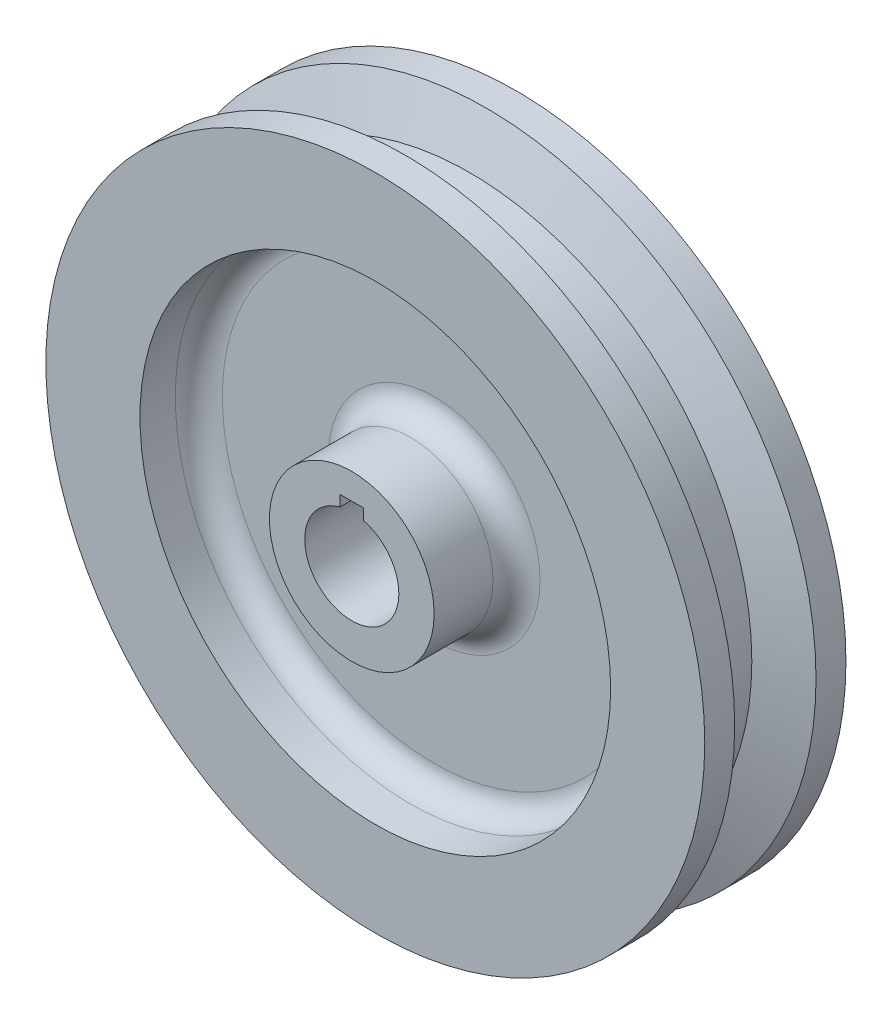
ISO-10303-21;
HEADER;
FILE_DESCRIPTION(('STEP AP214'),'2;1');
FILE_NAME('part.step','',(''),(''),'','','');
FILE_SCHEMA(('AUTOMOTIVE_DESIGN { 1 0 10303 214 1 1 1 1 }'));
ENDSEC;
DATA;
#1=APPLICATION_CONTEXT('core data for automotive mechanical design processes');
#2=APPLICATION_PROTOCOL_DEFINITION('international standard','automotive_design',2000,#1);
#3=PRODUCT_CONTEXT('',#1,'mechanical');
#4=PRODUCT('Part','Part','',(#3));
#5=PRODUCT_RELATED_PRODUCT_CATEGORY('part','',(#4));
#6=PRODUCT_DEFINITION_FORMATION('','',#4);
#7=PRODUCT_DEFINITION_CONTEXT('part definition',#1,'design');
#8=PRODUCT_DEFINITION('design','',#6,#7);
#9=PRODUCT_DEFINITION_SHAPE('','',#8);
#10=(LENGTH_UNIT() NAMED_UNIT(*) SI_UNIT(.MILLI.,.METRE.));
#11=(NAMED_UNIT(*) PLANE_ANGLE_UNIT() SI_UNIT($,.RADIAN.));
#12=(NAMED_UNIT(*) SI_UNIT($,.STERADIAN.) SOLID_ANGLE_UNIT());
#13=UNCERTAINTY_MEASURE_WITH_UNIT(LENGTH_MEASURE(1.E-05),#10,'distance_accuracy_value','');
#14=(GEOMETRIC_REPRESENTATION_CONTEXT(3) GLOBAL_UNCERTAINTY_ASSIGNED_CONTEXT((#13)) GLOBAL_UNIT_ASSIGNED_CONTEXT((#10,
#11,#12)) REPRESENTATION_CONTEXT('',''));
#15=CARTESIAN_POINT('',(0.,0.,0.));
#16=DIRECTION('',(0.,0.,1.));
#17=DIRECTION('',(1.,0.,0.));
#18=AXIS2_PLACEMENT_3D('',#15,#16,#17);
#19=CARTESIAN_POINT('',(0.,0.,0.));
#20=DIRECTION('',(0.,0.,1.));
#21=DIRECTION('',(1.,0.,0.));
#22=AXIS2_PLACEMENT_3D('',#19,#20,#21);
#23=CYLINDRICAL_SURFACE('',#22,88.9);
#24=CARTESIAN_POINT('',(0.,0.,19.05));
#25=DIRECTION('',(0.,0.,1.));
#26=DIRECTION('',(1.,0.,0.));
#27=AXIS2_PLACEMENT_3D('',#24,#25,#26);
#28=CIRCLE('',#27,88.9);
#29=CARTESIAN_POINT('',(88.9,0.,19.05));
#30=VERTEX_POINT('',#29);
#31=EDGE_CURVE('E115',#30,#30,#28,.T.);
#32=ORIENTED_EDGE('',*,*,#31,.F.);
#33=EDGE_LOOP('',(#32));
#34=FACE_BOUND('',#33,.T.);
#35=CARTESIAN_POINT('',(0.,0.,10.9724219751807));
#36=DIRECTION('',(0.,0.,1.));
#37=DIRECTION('',(1.,0.,0.));
#38=AXIS2_PLACEMENT_3D('',#35,#36,#37);
#39=CIRCLE('',#38,88.9);
#40=CARTESIAN_POINT('',(88.9,0.,10.9724219751807));
#41=VERTEX_POINT('',#40);
#42=EDGE_CURVE('E381',#41,#41,#39,.T.);
#43=ORIENTED_EDGE('',*,*,#42,.T.);
#44=EDGE_LOOP('',(#43));
#45=FACE_BOUND('',#44,.T.);
#46=ADVANCED_FACE('F39',(#34,#45),#23,.T.);
#47=CARTESIAN_POINT('',(0.,0.,-19.05));
#48=DIRECTION('',(0.,0.,1.));
#49=DIRECTION('',(1.,0.,0.));
#50=AXIS2_PLACEMENT_3D('',#47,#48,#49);
#51=CIRCLE('',#50,88.9);
#52=CARTESIAN_POINT('',(88.9,0.,-19.05));
#53=VERTEX_POINT('',#52);
#54=EDGE_CURVE('E384',#53,#53,#51,.T.);
#55=ORIENTED_EDGE('',*,*,#54,.T.);
#56=EDGE_LOOP('',(#55));
#57=FACE_BOUND('',#56,.T.);
#58=CARTESIAN_POINT('',(0.,0.,-10.9724219751807));
#59=DIRECTION('',(0.,0.,1.));
#60=DIRECTION('',(1.,0.,0.));
#61=AXIS2_PLACEMENT_3D('',#58,#59,#60);
#62=CIRCLE('',#61,88.9);
#63=CARTESIAN_POINT('',(88.9,0.,-10.9724219751807));
#64=VERTEX_POINT('',#63);
#65=EDGE_CURVE('E378',#64,#64,#62,.T.);
#66=ORIENTED_EDGE('',*,*,#65,.F.);
#67=EDGE_LOOP('',(#66));
#68=FACE_BOUND('',#67,.T.);
#69=ADVANCED_FACE('F157',(#57,#68),#23,.T.);
#70=CARTESIAN_POINT('',(0.,0.,19.05));
#71=DIRECTION('',(0.,0.,-1.));
#72=DIRECTION('',(-1.,0.,0.));
#73=AXIS2_PLACEMENT_3D('',#70,#71,#72);
#74=PLANE('',#73);
#75=CARTESIAN_POINT('',(0.,0.,19.05));
#76=DIRECTION('',(0.,0.,1.));
#77=DIRECTION('',(1.,0.,0.));
#78=AXIS2_PLACEMENT_3D('',#75,#76,#77);
#79=CIRCLE('',#78,63.5);
#80=CARTESIAN_POINT('',(63.5,0.,19.05));
#81=VERTEX_POINT('',#80);
#82=EDGE_CURVE('E112',#81,#81,#79,.T.);
#83=ORIENTED_EDGE('',*,*,#82,.F.);
#84=EDGE_LOOP('',(#83));
#85=FACE_BOUND('',#84,.T.);
#86=ORIENTED_EDGE('',*,*,#31,.T.);
#87=EDGE_LOOP('',(#86));
#88=FACE_BOUND('',#87,.T.);
#89=ADVANCED_FACE('F164',(#85,#88),#74,.F.);
#90=CARTESIAN_POINT('',(0.,0.,0.));
#91=DIRECTION('',(0.,0.,1.));
#92=DIRECTION('',(1.,0.,0.));
#93=AXIS2_PLACEMENT_3D('',#90,#91,#92);
#94=CYLINDRICAL_SURFACE('',#93,63.5);
#95=CARTESIAN_POINT('',(0.,0.,9.525));
#96=DIRECTION('',(0.,0.,1.));
#97=DIRECTION('',(1.,0.,0.));
#98=AXIS2_PLACEMENT_3D('',#95,#96,#97);
#99=CIRCLE('',#98,63.5);
#100=CARTESIAN_POINT('',(63.5,0.,9.525));
#101=VERTEX_POINT('',#100);
#102=EDGE_CURVE('E136',#101,#101,#99,.F.);
#103=ORIENTED_EDGE('',*,*,#102,.T.);
#104=EDGE_LOOP('',(#103));
#105=FACE_BOUND('',#104,.T.);
#106=ORIENTED_EDGE('',*,*,#82,.T.);
#107=EDGE_LOOP('',(#106));
#108=FACE_BOUND('',#107,.T.);
#109=ADVANCED_FACE('F197',(#105,#108),#94,.F.);
#110=CARTESIAN_POINT('',(0.,0.,3.175));
#111=DIRECTION('',(0.,0.,1.));
#112=DIRECTION('',(1.,0.,0.));
#113=AXIS2_PLACEMENT_3D('',#110,#111,#112);
#114=PLANE('',#113);
#115=CARTESIAN_POINT('',(0.,0.,3.175));
#116=DIRECTION('',(0.,0.,1.));
#117=DIRECTION('',(1.,0.,0.));
#118=AXIS2_PLACEMENT_3D('',#115,#116,#117);
#119=CIRCLE('',#118,57.15);
#120=CARTESIAN_POINT('',(57.15,0.,3.175));
#121=VERTEX_POINT('',#120);
#122=EDGE_CURVE('E133',#121,#121,#119,.T.);
#123=ORIENTED_EDGE('',*,*,#122,.T.);
#124=EDGE_LOOP('',(#123));
#125=FACE_BOUND('',#124,.T.);
#126=CARTESIAN_POINT('',(0.,0.,3.175));
#127=DIRECTION('',(0.,0.,1.));
#128=DIRECTION('',(1.,0.,0.));
#129=AXIS2_PLACEMENT_3D('',#126,#127,#128);
#130=CIRCLE('',#129,28.575);
#131=CARTESIAN_POINT('',(28.575,0.,3.175));
#132=VERTEX_POINT('',#131);
#133=EDGE_CURVE('E130',#132,#132,#130,.F.);
#134=ORIENTED_EDGE('',*,*,#133,.T.);
#135=EDGE_LOOP('',(#134));
#136=FACE_BOUND('',#135,.T.);
#137=ADVANCED_FACE('F210',(#125,#136),#114,.T.);
#138=CARTESIAN_POINT('',(0.,0.,0.));
#139=DIRECTION('',(0.,0.,1.));
#140=DIRECTION('',(1.,0.,0.));
#141=AXIS2_PLACEMENT_3D('',#138,#139,#140);
#142=CYLINDRICAL_SURFACE('',#141,22.225);
#143=CARTESIAN_POINT('',(0.,0.,9.525));
#144=DIRECTION('',(0.,0.,1.));
#145=DIRECTION('',(1.,0.,0.));
#146=AXIS2_PLACEMENT_3D('',#143,#144,#145);
#147=CIRCLE('',#146,22.225);
#148=CARTESIAN_POINT('',(22.225,0.,9.525));
#149=VERTEX_POINT('',#148);
#150=EDGE_CURVE('E47',#149,#149,#147,.T.);
#151=ORIENTED_EDGE('',*,*,#150,.T.);
#152=EDGE_LOOP('',(#151));
#153=FACE_BOUND('',#152,.T.);
#154=CARTESIAN_POINT('',(0.,0.,25.4));
#155=DIRECTION('',(0.,0.,1.));
#156=DIRECTION('',(1.,0.,0.));
#157=AXIS2_PLACEMENT_3D('',#154,#155,#156);
#158=CIRCLE('',#157,22.225);
#159=CARTESIAN_POINT('',(22.225,0.,25.4));
#160=VERTEX_POINT('',#159);
#161=EDGE_CURVE('E103',#160,#160,#158,.T.);
#162=ORIENTED_EDGE('',*,*,#161,.F.);
#163=EDGE_LOOP('',(#162));
#164=FACE_BOUND('',#163,.T.);
#165=ADVANCED_FACE('F141',(#153,#164),#142,.T.);
#166=CARTESIAN_POINT('',(0.,0.,25.4));
#167=DIRECTION('',(0.,0.,-1.));
#168=DIRECTION('',(-1.,0.,0.));
#169=AXIS2_PLACEMENT_3D('',#166,#167,#168);
#170=PLANE('',#169);
#171=DIRECTION('',(-1.,0.,0.));
#172=VECTOR('',#171,1.);
#173=CARTESIAN_POINT('',(3.175,15.24,25.4));
#174=LINE('',#173,#172);
#175=CARTESIAN_POINT('',(3.175,15.24,25.4));
#176=VERTEX_POINT('',#175);
#177=CARTESIAN_POINT('',(-3.175,15.24,25.4));
#178=VERTEX_POINT('',#177);
#179=EDGE_CURVE('E401',#176,#178,#174,.T.);
#180=ORIENTED_EDGE('',*,*,#179,.F.);
#181=DIRECTION('',(0.,1.,0.));
#182=VECTOR('',#181,1.);
#183=CARTESIAN_POINT('',(3.175,0.,25.4));
#184=LINE('',#183,#182);
#185=CARTESIAN_POINT('',(3.175,12.2967221242085,25.4));
#186=VERTEX_POINT('',#185);
#187=EDGE_CURVE('E80',#186,#176,#184,.T.);
#188=ORIENTED_EDGE('',*,*,#187,.F.);
#189=CARTESIAN_POINT('',(0.,0.,25.4));
#190=DIRECTION('',(0.,0.,1.));
#191=DIRECTION('',(1.,0.,0.));
#192=AXIS2_PLACEMENT_3D('',#189,#190,#191);
#193=CIRCLE('',#192,12.7);
#194=CARTESIAN_POINT('',(-3.175,12.2967221242085,25.4));
#195=VERTEX_POINT('',#194);
#196=EDGE_CURVE('E99',#195,#186,#193,.T.);
#197=ORIENTED_EDGE('',*,*,#196,.F.);
#198=DIRECTION('',(0.,-1.,0.));
#199=VECTOR('',#198,1.);
#200=CARTESIAN_POINT('',(-3.175,0.,25.4));
#201=LINE('',#200,#199);
#202=EDGE_CURVE('E90',#178,#195,#201,.T.);
#203=ORIENTED_EDGE('',*,*,#202,.F.);
#204=EDGE_LOOP('',(#180,#188,#197,#203));
#205=FACE_BOUND('',#204,.T.);
#206=ORIENTED_EDGE('',*,*,#161,.T.);
#207=EDGE_LOOP('',(#206));
#208=FACE_BOUND('',#207,.T.);
#209=ADVANCED_FACE('F207',(#205,#208),#170,.F.);
#210=CARTESIAN_POINT('',(0.,0.,0.));
#211=DIRECTION('',(0.,0.,1.));
#212=DIRECTION('',(1.,0.,0.));
#213=AXIS2_PLACEMENT_3D('',#210,#211,#212);
#214=CYLINDRICAL_SURFACE('',#213,12.7);
#215=DIRECTION('',(0.,0.,1.));
#216=VECTOR('',#215,1.);
#217=CARTESIAN_POINT('',(3.175,12.2967221242086,0.));
#218=LINE('',#217,#216);
#219=CARTESIAN_POINT('',(3.175,12.2967221242085,-25.4));
#220=VERTEX_POINT('',#219);
#221=EDGE_CURVE('E367',#220,#186,#218,.T.);
#222=ORIENTED_EDGE('',*,*,#221,.F.);
#223=CARTESIAN_POINT('',(0.,0.,-25.4));
#224=DIRECTION('',(0.,0.,1.));
#225=DIRECTION('',(1.,0.,0.));
#226=AXIS2_PLACEMENT_3D('',#223,#224,#225);
#227=CIRCLE('',#226,12.7);
#228=CARTESIAN_POINT('',(-3.175,12.2967221242085,-25.4));
#229=VERTEX_POINT('',#228);
#230=EDGE_CURVE('E96',#229,#220,#227,.T.);
#231=ORIENTED_EDGE('',*,*,#230,.F.);
#232=DIRECTION('',(0.,0.,1.));
#233=VECTOR('',#232,1.);
#234=CARTESIAN_POINT('',(-3.175,12.2967221242086,0.));
#235=LINE('',#234,#233);
#236=EDGE_CURVE('E364',#195,#229,#235,.F.);
#237=ORIENTED_EDGE('',*,*,#236,.F.);
#238=ORIENTED_EDGE('',*,*,#196,.T.);
#239=EDGE_LOOP('',(#222,#231,#237,#238));
#240=FACE_BOUND('',#239,.T.);
#241=ADVANCED_FACE('F204',(#240),#214,.F.);
#242=CARTESIAN_POINT('',(0.,0.,-25.4));
#243=DIRECTION('',(0.,0.,-1.));
#244=DIRECTION('',(-1.,0.,0.));
#245=AXIS2_PLACEMENT_3D('',#242,#243,#244);
#246=PLANE('',#245);
#247=DIRECTION('',(0.,-1.,0.));
#248=VECTOR('',#247,1.);
#249=CARTESIAN_POINT('',(3.175,0.,-25.4));
#250=LINE('',#249,#248);
#251=CARTESIAN_POINT('',(3.175,15.24,-25.4));
#252=VERTEX_POINT('',#251);
#253=EDGE_CURVE('E11',#252,#220,#250,.T.);
#254=ORIENTED_EDGE('',*,*,#253,.F.);
#255=DIRECTION('',(-1.,0.,0.));
#256=VECTOR('',#255,1.);
#257=CARTESIAN_POINT('',(3.175,15.24,-25.4));
#258=LINE('',#257,#256);
#259=CARTESIAN_POINT('',(-3.175,15.24,-25.4));
#260=VERTEX_POINT('',#259);
#261=EDGE_CURVE('E87',#252,#260,#258,.T.);
#262=ORIENTED_EDGE('',*,*,#261,.T.);
#263=DIRECTION('',(0.,-1.,0.));
#264=VECTOR('',#263,1.);
#265=CARTESIAN_POINT('',(-3.175,0.,-25.4));
#266=LINE('',#265,#264);
#267=EDGE_CURVE('E54',#260,#229,#266,.T.);
#268=ORIENTED_EDGE('',*,*,#267,.T.);
#269=ORIENTED_EDGE('',*,*,#230,.T.);
#270=EDGE_LOOP('',(#254,#262,#268,#269));
#271=FACE_BOUND('',#270,.T.);
#272=CARTESIAN_POINT('',(0.,0.,-25.4));
#273=DIRECTION('',(0.,0.,1.));
#274=DIRECTION('',(1.,0.,0.));
#275=AXIS2_PLACEMENT_3D('',#272,#273,#274);
#276=CIRCLE('',#275,22.225);
#277=CARTESIAN_POINT('',(22.225,0.,-25.4));
#278=VERTEX_POINT('',#277);
#279=EDGE_CURVE('E100',#278,#278,#276,.T.);
#280=ORIENTED_EDGE('',*,*,#279,.F.);
#281=EDGE_LOOP('',(#280));
#282=FACE_BOUND('',#281,.T.);
#283=ADVANCED_FACE('F93',(#271,#282),#246,.T.);
#284=CARTESIAN_POINT('',(0.,0.,-9.525));
#285=DIRECTION('',(0.,0.,1.));
#286=DIRECTION('',(1.,0.,0.));
#287=AXIS2_PLACEMENT_3D('',#284,#285,#286);
#288=CIRCLE('',#287,22.225);
#289=CARTESIAN_POINT('',(22.225,0.,-9.525));
#290=VERTEX_POINT('',#289);
#291=EDGE_CURVE('E127',#290,#290,#288,.F.);
#292=ORIENTED_EDGE('',*,*,#291,.T.);
#293=EDGE_LOOP('',(#292));
#294=FACE_BOUND('',#293,.T.);
#295=ORIENTED_EDGE('',*,*,#279,.T.);
#296=EDGE_LOOP('',(#295));
#297=FACE_BOUND('',#296,.T.);
#298=ADVANCED_FACE('F187',(#294,#297),#142,.T.);
#299=CARTESIAN_POINT('',(0.,0.,-3.175));
#300=DIRECTION('',(0.,0.,1.));
#301=DIRECTION('',(1.,0.,0.));
#302=AXIS2_PLACEMENT_3D('',#299,#300,#301);
#303=PLANE('',#302);
#304=CARTESIAN_POINT('',(0.,0.,-3.175));
#305=DIRECTION('',(0.,0.,1.));
#306=DIRECTION('',(1.,0.,0.));
#307=AXIS2_PLACEMENT_3D('',#304,#305,#306);
#308=CIRCLE('',#307,57.15);
#309=CARTESIAN_POINT('',(57.15,0.,-3.175));
#310=VERTEX_POINT('',#309);
#311=EDGE_CURVE('E124',#310,#310,#308,.F.);
#312=ORIENTED_EDGE('',*,*,#311,.T.);
#313=EDGE_LOOP('',(#312));
#314=FACE_BOUND('',#313,.T.);
#315=CARTESIAN_POINT('',(0.,0.,-3.175));
#316=DIRECTION('',(0.,0.,1.));
#317=DIRECTION('',(1.,0.,0.));
#318=AXIS2_PLACEMENT_3D('',#315,#316,#317);
#319=CIRCLE('',#318,28.575);
#320=CARTESIAN_POINT('',(28.575,0.,-3.175));
#321=VERTEX_POINT('',#320);
#322=EDGE_CURVE('E121',#321,#321,#319,.T.);
#323=ORIENTED_EDGE('',*,*,#322,.T.);
#324=EDGE_LOOP('',(#323));
#325=FACE_BOUND('',#324,.T.);
#326=ADVANCED_FACE('F184',(#314,#325),#303,.F.);
#327=CARTESIAN_POINT('',(0.,0.,-9.525));
#328=DIRECTION('',(0.,0.,1.));
#329=DIRECTION('',(1.,0.,0.));
#330=AXIS2_PLACEMENT_3D('',#327,#328,#329);
#331=CIRCLE('',#330,63.5);
#332=CARTESIAN_POINT('',(63.5,0.,-9.525));
#333=VERTEX_POINT('',#332);
#334=EDGE_CURVE('E118',#333,#333,#331,.T.);
#335=ORIENTED_EDGE('',*,*,#334,.T.);
#336=EDGE_LOOP('',(#335));
#337=FACE_BOUND('',#336,.T.);
#338=CARTESIAN_POINT('',(0.,0.,-19.05));
#339=DIRECTION('',(0.,0.,1.));
#340=DIRECTION('',(1.,0.,0.));
#341=AXIS2_PLACEMENT_3D('',#338,#339,#340);
#342=CIRCLE('',#341,63.5);
#343=CARTESIAN_POINT('',(63.5,0.,-19.05));
#344=VERTEX_POINT('',#343);
#345=EDGE_CURVE('E106',#344,#344,#342,.T.);
#346=ORIENTED_EDGE('',*,*,#345,.F.);
#347=EDGE_LOOP('',(#346));
#348=FACE_BOUND('',#347,.T.);
#349=ADVANCED_FACE('F186',(#337,#348),#94,.F.);
#350=CARTESIAN_POINT('',(0.,0.,-19.05));
#351=DIRECTION('',(0.,0.,-1.));
#352=DIRECTION('',(-1.,0.,0.));
#353=AXIS2_PLACEMENT_3D('',#350,#351,#352);
#354=PLANE('',#353);
#355=ORIENTED_EDGE('',*,*,#345,.T.);
#356=EDGE_LOOP('',(#355));
#357=FACE_BOUND('',#356,.T.);
#358=ORIENTED_EDGE('',*,*,#54,.F.);
#359=EDGE_LOOP('',(#358));
#360=FACE_BOUND('',#359,.T.);
#361=ADVANCED_FACE('F194',(#357,#360),#354,.T.);
#362=CARTESIAN_POINT('',(0.,0.,10.9724219751807));
#363=DIRECTION('',(0.,0.,1.));
#364=DIRECTION('',(1.,0.,0.));
#365=AXIS2_PLACEMENT_3D('',#362,#363,#364);
#366=CONICAL_SURFACE('',#365,88.9,1.22173047639603);
#367=CARTESIAN_POINT('',(0.,0.,6.35));
#368=DIRECTION('',(0.,0.,1.));
#369=DIRECTION('',(1.,0.,0.));
#370=AXIS2_PLACEMENT_3D('',#367,#368,#369);
#371=CIRCLE('',#370,76.2);
#372=CARTESIAN_POINT('',(76.2,0.,6.35));
#373=VERTEX_POINT('',#372);
#374=EDGE_CURVE('E369',#373,#373,#371,.T.);
#375=ORIENTED_EDGE('',*,*,#374,.T.);
#376=EDGE_LOOP('',(#375));
#377=FACE_BOUND('',#376,.T.);
#378=ORIENTED_EDGE('',*,*,#42,.F.);
#379=EDGE_LOOP('',(#378));
#380=FACE_BOUND('',#379,.T.);
#381=ADVANCED_FACE('F292',(#377,#380),#366,.T.);
#382=CARTESIAN_POINT('',(0.,0.,-6.35));
#383=DIRECTION('',(0.,0.,-1.));
#384=DIRECTION('',(-1.,0.,0.));
#385=AXIS2_PLACEMENT_3D('',#382,#383,#384);
#386=CONICAL_SURFACE('',#385,76.2,1.22173047639603);
#387=ORIENTED_EDGE('',*,*,#65,.T.);
#388=EDGE_LOOP('',(#387));
#389=FACE_BOUND('',#388,.T.);
#390=CARTESIAN_POINT('',(0.,0.,-6.35));
#391=DIRECTION('',(0.,0.,1.));
#392=DIRECTION('',(1.,0.,0.));
#393=AXIS2_PLACEMENT_3D('',#390,#391,#392);
#394=CIRCLE('',#393,76.2);
#395=CARTESIAN_POINT('',(76.2,0.,-6.35));
#396=VERTEX_POINT('',#395);
#397=EDGE_CURVE('E375',#396,#396,#394,.T.);
#398=ORIENTED_EDGE('',*,*,#397,.F.);
#399=EDGE_LOOP('',(#398));
#400=FACE_BOUND('',#399,.T.);
#401=ADVANCED_FACE('F308',(#389,#400),#386,.T.);
#402=CARTESIAN_POINT('',(0.,0.,0.));
#403=DIRECTION('',(0.,0.,1.));
#404=DIRECTION('',(1.,0.,0.));
#405=AXIS2_PLACEMENT_3D('',#402,#403,#404);
#406=CYLINDRICAL_SURFACE('',#405,76.2);
#407=ORIENTED_EDGE('',*,*,#397,.T.);
#408=EDGE_LOOP('',(#407));
#409=FACE_BOUND('',#408,.T.);
#410=ORIENTED_EDGE('',*,*,#374,.F.);
#411=EDGE_LOOP('',(#410));
#412=FACE_BOUND('',#411,.T.);
#413=ADVANCED_FACE('F174',(#409,#412),#406,.T.);
#414=CARTESIAN_POINT('',(0.,0.,-9.525));
#415=DIRECTION('',(0.,0.,1.));
#416=DIRECTION('',(1.,0.,0.));
#417=AXIS2_PLACEMENT_3D('',#414,#415,#416);
#418=TOROIDAL_SURFACE('',#417,57.15,6.35);
#419=ORIENTED_EDGE('',*,*,#311,.F.);
#420=EDGE_LOOP('',(#419));
#421=FACE_BOUND('',#420,.T.);
#422=ORIENTED_EDGE('',*,*,#334,.F.);
#423=EDGE_LOOP('',(#422));
#424=FACE_BOUND('',#423,.T.);
#425=ADVANCED_FACE('F171',(#421,#424),#418,.F.);
#426=CARTESIAN_POINT('',(0.,0.,-9.525));
#427=DIRECTION('',(0.,0.,1.));
#428=DIRECTION('',(1.,0.,0.));
#429=AXIS2_PLACEMENT_3D('',#426,#427,#428);
#430=TOROIDAL_SURFACE('',#429,28.575,6.35);
#431=ORIENTED_EDGE('',*,*,#291,.F.);
#432=EDGE_LOOP('',(#431));
#433=FACE_BOUND('',#432,.T.);
#434=ORIENTED_EDGE('',*,*,#322,.F.);
#435=EDGE_LOOP('',(#434));
#436=FACE_BOUND('',#435,.T.);
#437=ADVANCED_FACE('F153',(#433,#436),#430,.F.);
#438=CARTESIAN_POINT('',(0.,0.,9.525));
#439=DIRECTION('',(0.,0.,1.));
#440=DIRECTION('',(1.,0.,0.));
#441=AXIS2_PLACEMENT_3D('',#438,#439,#440);
#442=TOROIDAL_SURFACE('',#441,57.15,6.35);
#443=ORIENTED_EDGE('',*,*,#102,.F.);
#444=EDGE_LOOP('',(#443));
#445=FACE_BOUND('',#444,.T.);
#446=ORIENTED_EDGE('',*,*,#122,.F.);
#447=EDGE_LOOP('',(#446));
#448=FACE_BOUND('',#447,.T.);
#449=ADVANCED_FACE('F145',(#445,#448),#442,.F.);
#450=CARTESIAN_POINT('',(0.,0.,9.525));
#451=DIRECTION('',(0.,0.,1.));
#452=DIRECTION('',(1.,0.,0.));
#453=AXIS2_PLACEMENT_3D('',#450,#451,#452);
#454=TOROIDAL_SURFACE('',#453,28.575,6.35);
#455=ORIENTED_EDGE('',*,*,#133,.F.);
#456=EDGE_LOOP('',(#455));
#457=FACE_BOUND('',#456,.T.);
#458=ORIENTED_EDGE('',*,*,#150,.F.);
#459=EDGE_LOOP('',(#458));
#460=FACE_BOUND('',#459,.T.);
#461=ADVANCED_FACE('F41',(#457,#460),#454,.F.);
#462=CARTESIAN_POINT('',(3.175,0.,-25.4));
#463=DIRECTION('',(1.,0.,0.));
#464=DIRECTION('',(0.,0.,-1.));
#465=AXIS2_PLACEMENT_3D('',#462,#463,#464);
#466=PLANE('',#465);
#467=ORIENTED_EDGE('',*,*,#221,.T.);
#468=ORIENTED_EDGE('',*,*,#187,.T.);
#469=DIRECTION('',(0.,0.,1.));
#470=VECTOR('',#469,1.);
#471=CARTESIAN_POINT('',(3.175,15.24,-25.4));
#472=LINE('',#471,#470);
#473=EDGE_CURVE('E76',#252,#176,#472,.T.);
#474=ORIENTED_EDGE('',*,*,#473,.F.);
#475=ORIENTED_EDGE('',*,*,#253,.T.);
#476=EDGE_LOOP('',(#467,#468,#474,#475));
#477=FACE_BOUND('',#476,.T.);
#478=ADVANCED_FACE('F78',(#477),#466,.F.);
#479=CARTESIAN_POINT('',(-3.175,0.,-25.4));
#480=DIRECTION('',(-1.,0.,0.));
#481=DIRECTION('',(0.,0.,1.));
#482=AXIS2_PLACEMENT_3D('',#479,#480,#481);
#483=PLANE('',#482);
#484=ORIENTED_EDGE('',*,*,#236,.T.);
#485=ORIENTED_EDGE('',*,*,#267,.F.);
#486=DIRECTION('',(0.,0.,1.));
#487=VECTOR('',#486,1.);
#488=CARTESIAN_POINT('',(-3.175,15.24,-25.4));
#489=LINE('',#488,#487);
#490=EDGE_CURVE('E84',#260,#178,#489,.T.);
#491=ORIENTED_EDGE('',*,*,#490,.T.);
#492=ORIENTED_EDGE('',*,*,#202,.T.);
#493=EDGE_LOOP('',(#484,#485,#491,#492));
#494=FACE_BOUND('',#493,.T.);
#495=ADVANCED_FACE('F151',(#494),#483,.F.);
#496=CARTESIAN_POINT('',(3.175,15.24,-25.4));
#497=DIRECTION('',(0.,1.,0.));
#498=DIRECTION('',(0.,0.,1.));
#499=AXIS2_PLACEMENT_3D('',#496,#497,#498);
#500=PLANE('',#499);
#501=ORIENTED_EDGE('',*,*,#179,.T.);
#502=ORIENTED_EDGE('',*,*,#490,.F.);
#503=ORIENTED_EDGE('',*,*,#261,.F.);
#504=ORIENTED_EDGE('',*,*,#473,.T.);
#505=EDGE_LOOP('',(#501,#502,#503,#504));
#506=FACE_BOUND('',#505,.T.);
#507=ADVANCED_FACE('F88',(#506),#500,.F.);
#508=CLOSED_SHELL('',(#46,#69,#89,#109,#137,#165,#209,#241,#283,#298,#326,#349,#361,#381,#401,
#413,#425,#437,#449,#461,#478,#495,#507));
#509=MANIFOLD_SOLID_BREP('B2',#508);
#510=ADVANCED_BREP_SHAPE_REPRESENTATION('',(#18,#509),#14);
#511=SHAPE_DEFINITION_REPRESENTATION(#9,#510);
ENDSEC;
END-ISO-10303-21;
